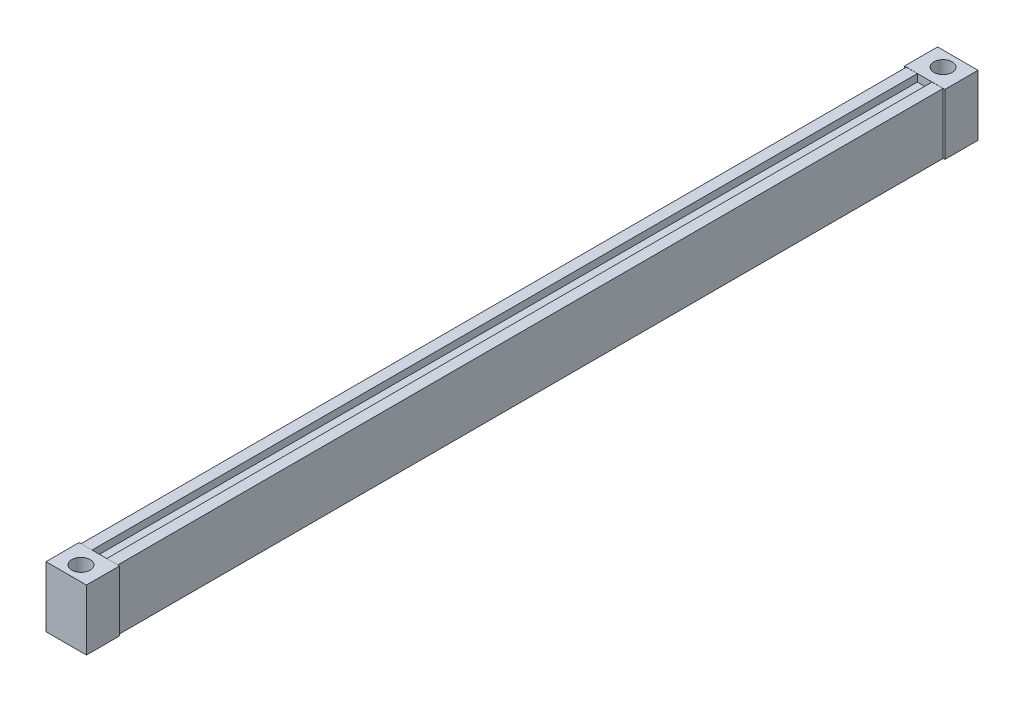
ISO-10303-21;
HEADER;
FILE_DESCRIPTION(('STEP AP214'),'2;1');
FILE_NAME('part.step','',(''),(''),'','','');
FILE_SCHEMA(('AUTOMOTIVE_DESIGN { 1 0 10303 214 1 1 1 1 }'));
ENDSEC;
DATA;
#1=APPLICATION_CONTEXT('core data for automotive mechanical design processes');
#2=APPLICATION_PROTOCOL_DEFINITION('international standard','automotive_design',2000,#1);
#3=PRODUCT_CONTEXT('',#1,'mechanical');
#4=PRODUCT('Part','Part','',(#3));
#5=PRODUCT_RELATED_PRODUCT_CATEGORY('part','',(#4));
#6=PRODUCT_DEFINITION_FORMATION('','',#4);
#7=PRODUCT_DEFINITION_CONTEXT('part definition',#1,'design');
#8=PRODUCT_DEFINITION('design','',#6,#7);
#9=PRODUCT_DEFINITION_SHAPE('','',#8);
#10=(LENGTH_UNIT() NAMED_UNIT(*) SI_UNIT(.MILLI.,.METRE.));
#11=(NAMED_UNIT(*) PLANE_ANGLE_UNIT() SI_UNIT($,.RADIAN.));
#12=(NAMED_UNIT(*) SI_UNIT($,.STERADIAN.) SOLID_ANGLE_UNIT());
#13=UNCERTAINTY_MEASURE_WITH_UNIT(LENGTH_MEASURE(1.E-05),#10,'distance_accuracy_value','');
#14=(GEOMETRIC_REPRESENTATION_CONTEXT(3) GLOBAL_UNCERTAINTY_ASSIGNED_CONTEXT((#13)) GLOBAL_UNIT_ASSIGNED_CONTEXT((#10,
#11,#12)) REPRESENTATION_CONTEXT('',''));
#15=CARTESIAN_POINT('',(0.,0.,0.));
#16=DIRECTION('',(0.,0.,1.));
#17=DIRECTION('',(1.,0.,0.));
#18=AXIS2_PLACEMENT_3D('',#15,#16,#17);
#19=CARTESIAN_POINT('',(-4.49999999999997,-7.74074074074076,234.5));
#20=DIRECTION('',(0.,1.,0.));
#21=DIRECTION('',(-1.,0.,0.));
#22=AXIS2_PLACEMENT_3D('',#19,#20,#21);
#23=CYLINDRICAL_SURFACE('',#22,2.5);
#24=CARTESIAN_POINT('',(-4.49999999999997,-7.6791153095827,234.5));
#25=DIRECTION('',(0.,-1.,0.));
#26=DIRECTION('',(-1.,0.,0.));
#27=AXIS2_PLACEMENT_3D('',#24,#25,#26);
#28=CIRCLE('',#27,2.5);
#29=CARTESIAN_POINT('',(-6.99999999999998,-7.6791153095827,234.5));
#30=VERTEX_POINT('',#29);
#31=EDGE_CURVE('E121',#30,#30,#28,.T.);
#32=ORIENTED_EDGE('',*,*,#31,.T.);
#33=EDGE_LOOP('',(#32));
#34=FACE_BOUND('',#33,.T.);
#35=CARTESIAN_POINT('',(-4.49999999999997,-2.6791153095827,234.5));
#36=DIRECTION('',(0.,-1.,0.));
#37=DIRECTION('',(-1.,0.,0.));
#38=AXIS2_PLACEMENT_3D('',#35,#36,#37);
#39=CIRCLE('',#38,2.5);
#40=CARTESIAN_POINT('',(-6.99999999999998,-2.6791153095827,234.5));
#41=VERTEX_POINT('',#40);
#42=EDGE_CURVE('E168',#41,#41,#39,.T.);
#43=ORIENTED_EDGE('',*,*,#42,.F.);
#44=EDGE_LOOP('',(#43));
#45=FACE_BOUND('',#44,.T.);
#46=ADVANCED_FACE('F52',(#34,#45),#23,.F.);
#47=CARTESIAN_POINT('',(6.50000000000002,0.,242.5));
#48=DIRECTION('',(1.,0.,0.));
#49=DIRECTION('',(0.,1.,0.));
#50=AXIS2_PLACEMENT_3D('',#47,#48,#49);
#51=PLANE('',#50);
#52=DIRECTION('',(0.,1.,0.));
#53=VECTOR('',#52,1.);
#54=CARTESIAN_POINT('',(6.50000000000002,0.,224.5));
#55=LINE('',#54,#53);
#56=CARTESIAN_POINT('',(6.50000000000002,-7.6791153095827,224.5));
#57=VERTEX_POINT('',#56);
#58=CARTESIAN_POINT('',(6.50000000000002,25.3208846904173,224.5));
#59=VERTEX_POINT('',#58);
#60=EDGE_CURVE('E117',#57,#59,#55,.T.);
#61=ORIENTED_EDGE('',*,*,#60,.T.);
#62=DIRECTION('',(0.,0.,-1.));
#63=VECTOR('',#62,1.);
#64=CARTESIAN_POINT('',(6.50000000000002,25.3208846904173,242.5));
#65=LINE('',#64,#63);
#66=CARTESIAN_POINT('',(6.50000000000002,25.3208846904173,242.5));
#67=VERTEX_POINT('',#66);
#68=EDGE_CURVE('E116',#67,#59,#65,.T.);
#69=ORIENTED_EDGE('',*,*,#68,.F.);
#70=DIRECTION('',(0.,1.,0.));
#71=VECTOR('',#70,1.);
#72=CARTESIAN_POINT('',(6.50000000000002,0.,242.5));
#73=LINE('',#72,#71);
#74=CARTESIAN_POINT('',(6.50000000000002,-7.6791153095827,242.5));
#75=VERTEX_POINT('',#74);
#76=EDGE_CURVE('E110',#75,#67,#73,.T.);
#77=ORIENTED_EDGE('',*,*,#76,.F.);
#78=DIRECTION('',(0.,0.,-1.));
#79=VECTOR('',#78,1.);
#80=CARTESIAN_POINT('',(6.50000000000002,-7.6791153095827,242.5));
#81=LINE('',#80,#79);
#82=EDGE_CURVE('E12',#75,#57,#81,.T.);
#83=ORIENTED_EDGE('',*,*,#82,.T.);
#84=EDGE_LOOP('',(#61,#69,#77,#83));
#85=FACE_BOUND('',#84,.T.);
#86=ADVANCED_FACE('F54',(#85),#51,.T.);
#87=CARTESIAN_POINT('',(0.,-7.6791153095827,242.5));
#88=DIRECTION('',(0.,1.,0.));
#89=DIRECTION('',(-1.,0.,0.));
#90=AXIS2_PLACEMENT_3D('',#87,#88,#89);
#91=PLANE('',#90);
#92=ORIENTED_EDGE('',*,*,#31,.F.);
#93=EDGE_LOOP('',(#92));
#94=FACE_BOUND('',#93,.T.);
#95=DIRECTION('',(-1.,0.,0.));
#96=VECTOR('',#95,1.);
#97=CARTESIAN_POINT('',(0.,-7.6791153095827,224.5));
#98=LINE('',#97,#96);
#99=CARTESIAN_POINT('',(-15.5,-7.6791153095827,224.5));
#100=VERTEX_POINT('',#99);
#101=EDGE_CURVE('E120',#57,#100,#98,.T.);
#102=ORIENTED_EDGE('',*,*,#101,.F.);
#103=ORIENTED_EDGE('',*,*,#82,.F.);
#104=DIRECTION('',(-1.,0.,0.));
#105=VECTOR('',#104,1.);
#106=CARTESIAN_POINT('',(0.,-7.6791153095827,242.5));
#107=LINE('',#106,#105);
#108=CARTESIAN_POINT('',(-15.5,-7.6791153095827,242.5));
#109=VERTEX_POINT('',#108);
#110=EDGE_CURVE('E94',#75,#109,#107,.T.);
#111=ORIENTED_EDGE('',*,*,#110,.T.);
#112=DIRECTION('',(0.,0.,-1.));
#113=VECTOR('',#112,1.);
#114=CARTESIAN_POINT('',(-15.5,-7.6791153095827,242.5));
#115=LINE('',#114,#113);
#116=EDGE_CURVE('E61',#109,#100,#115,.T.);
#117=ORIENTED_EDGE('',*,*,#116,.T.);
#118=EDGE_LOOP('',(#102,#103,#111,#117));
#119=FACE_BOUND('',#118,.T.);
#120=ADVANCED_FACE('F108',(#94,#119),#91,.F.);
#121=CARTESIAN_POINT('',(-15.5,0.,242.5));
#122=DIRECTION('',(1.,0.,0.));
#123=DIRECTION('',(0.,1.,0.));
#124=AXIS2_PLACEMENT_3D('',#121,#122,#123);
#125=PLANE('',#124);
#126=DIRECTION('',(0.,1.,0.));
#127=VECTOR('',#126,1.);
#128=CARTESIAN_POINT('',(-15.5,0.,224.5));
#129=LINE('',#128,#127);
#130=CARTESIAN_POINT('',(-15.5,25.3208846904173,224.5));
#131=VERTEX_POINT('',#130);
#132=EDGE_CURVE('E104',#100,#131,#129,.T.);
#133=ORIENTED_EDGE('',*,*,#132,.F.);
#134=ORIENTED_EDGE('',*,*,#116,.F.);
#135=DIRECTION('',(0.,1.,0.));
#136=VECTOR('',#135,1.);
#137=CARTESIAN_POINT('',(-15.5,0.,242.5));
#138=LINE('',#137,#136);
#139=CARTESIAN_POINT('',(-15.5,25.3208846904173,242.5));
#140=VERTEX_POINT('',#139);
#141=EDGE_CURVE('E97',#109,#140,#138,.T.);
#142=ORIENTED_EDGE('',*,*,#141,.T.);
#143=DIRECTION('',(0.,0.,-1.));
#144=VECTOR('',#143,1.);
#145=CARTESIAN_POINT('',(-15.5,25.3208846904173,242.5));
#146=LINE('',#145,#144);
#147=EDGE_CURVE('E107',#140,#131,#146,.T.);
#148=ORIENTED_EDGE('',*,*,#147,.T.);
#149=EDGE_LOOP('',(#133,#134,#142,#148));
#150=FACE_BOUND('',#149,.T.);
#151=ADVANCED_FACE('F103',(#150),#125,.F.);
#152=CARTESIAN_POINT('',(0.,25.3208846904173,242.5));
#153=DIRECTION('',(0.,1.,0.));
#154=DIRECTION('',(-1.,0.,0.));
#155=AXIS2_PLACEMENT_3D('',#152,#153,#154);
#156=PLANE('',#155);
#157=CARTESIAN_POINT('',(-4.49999999999997,25.3208846904173,234.5));
#158=DIRECTION('',(0.,-1.,0.));
#159=DIRECTION('',(-1.,0.,0.));
#160=AXIS2_PLACEMENT_3D('',#157,#158,#159);
#161=CIRCLE('',#160,5.);
#162=CARTESIAN_POINT('',(-9.49999999999997,25.3208846904173,234.5));
#163=VERTEX_POINT('',#162);
#164=EDGE_CURVE('E167',#163,#163,#161,.T.);
#165=ORIENTED_EDGE('',*,*,#164,.T.);
#166=EDGE_LOOP('',(#165));
#167=FACE_BOUND('',#166,.T.);
#168=DIRECTION('',(-1.,0.,0.));
#169=VECTOR('',#168,1.);
#170=CARTESIAN_POINT('',(0.,25.3208846904173,224.5));
#171=LINE('',#170,#169);
#172=EDGE_CURVE('E83',#59,#131,#171,.T.);
#173=ORIENTED_EDGE('',*,*,#172,.T.);
#174=ORIENTED_EDGE('',*,*,#147,.F.);
#175=DIRECTION('',(-1.,0.,0.));
#176=VECTOR('',#175,1.);
#177=CARTESIAN_POINT('',(0.,25.3208846904173,242.5));
#178=LINE('',#177,#176);
#179=EDGE_CURVE('E69',#67,#140,#178,.T.);
#180=ORIENTED_EDGE('',*,*,#179,.F.);
#181=ORIENTED_EDGE('',*,*,#68,.T.);
#182=EDGE_LOOP('',(#173,#174,#180,#181));
#183=FACE_BOUND('',#182,.T.);
#184=ADVANCED_FACE('F129',(#167,#183),#156,.T.);
#185=CARTESIAN_POINT('',(0.,0.,242.5));
#186=DIRECTION('',(0.,0.,1.));
#187=DIRECTION('',(-1.,0.,0.));
#188=AXIS2_PLACEMENT_3D('',#185,#186,#187);
#189=PLANE('',#188);
#190=ORIENTED_EDGE('',*,*,#76,.T.);
#191=ORIENTED_EDGE('',*,*,#179,.T.);
#192=ORIENTED_EDGE('',*,*,#141,.F.);
#193=ORIENTED_EDGE('',*,*,#110,.F.);
#194=EDGE_LOOP('',(#190,#191,#192,#193));
#195=FACE_BOUND('',#194,.T.);
#196=ADVANCED_FACE('F99',(#195),#189,.T.);
#197=CARTESIAN_POINT('',(0.,0.,224.5));
#198=DIRECTION('',(0.,0.,1.));
#199=DIRECTION('',(-1.,0.,0.));
#200=AXIS2_PLACEMENT_3D('',#197,#198,#199);
#201=PLANE('',#200);
#202=ORIENTED_EDGE('',*,*,#60,.F.);
#203=ORIENTED_EDGE('',*,*,#101,.T.);
#204=ORIENTED_EDGE('',*,*,#132,.T.);
#205=ORIENTED_EDGE('',*,*,#172,.F.);
#206=EDGE_LOOP('',(#202,#203,#204,#205));
#207=FACE_BOUND('',#206,.T.);
#208=ADVANCED_FACE('F126',(#207),#201,.F.);
#209=CARTESIAN_POINT('',(-4.49999999999997,-2.6791153095827,234.5));
#210=DIRECTION('',(0.,1.,0.));
#211=DIRECTION('',(-1.,0.,0.));
#212=AXIS2_PLACEMENT_3D('',#209,#210,#211);
#213=CYLINDRICAL_SURFACE('',#212,5.);
#214=CARTESIAN_POINT('',(-4.49999999999997,-2.6791153095827,234.5));
#215=DIRECTION('',(0.,-1.,0.));
#216=DIRECTION('',(-1.,0.,0.));
#217=AXIS2_PLACEMENT_3D('',#214,#215,#216);
#218=CIRCLE('',#217,5.);
#219=CARTESIAN_POINT('',(-9.49999999999998,-2.6791153095827,234.5));
#220=VERTEX_POINT('',#219);
#221=EDGE_CURVE('E165',#220,#220,#218,.T.);
#222=ORIENTED_EDGE('',*,*,#221,.T.);
#223=EDGE_LOOP('',(#222));
#224=FACE_BOUND('',#223,.T.);
#225=ORIENTED_EDGE('',*,*,#164,.F.);
#226=EDGE_LOOP('',(#225));
#227=FACE_BOUND('',#226,.T.);
#228=ADVANCED_FACE('F150',(#224,#227),#213,.F.);
#229=CARTESIAN_POINT('',(-4.49999999999997,-2.6791153095827,234.5));
#230=DIRECTION('',(0.,1.,0.));
#231=DIRECTION('',(-1.,0.,0.));
#232=AXIS2_PLACEMENT_3D('',#229,#230,#231);
#233=PLANE('',#232);
#234=ORIENTED_EDGE('',*,*,#42,.T.);
#235=EDGE_LOOP('',(#234));
#236=FACE_BOUND('',#235,.T.);
#237=ORIENTED_EDGE('',*,*,#221,.F.);
#238=EDGE_LOOP('',(#237));
#239=FACE_BOUND('',#238,.T.);
#240=ADVANCED_FACE('F156',(#236,#239),#233,.T.);
#241=CLOSED_SHELL('',(#46,#86,#120,#151,#184,#196,#208,#228,#240));
#242=MANIFOLD_SOLID_BREP('B2',#241);
#243=CARTESIAN_POINT('',(-4.49999999999997,-7.74074074074076,-234.5));
#244=DIRECTION('',(0.,1.,0.));
#245=DIRECTION('',(-1.,0.,0.));
#246=AXIS2_PLACEMENT_3D('',#243,#244,#245);
#247=CYLINDRICAL_SURFACE('',#246,2.5);
#248=CARTESIAN_POINT('',(-4.49999999999997,-7.6791153095827,-234.5));
#249=DIRECTION('',(0.,1.,0.));
#250=DIRECTION('',(-1.,0.,0.));
#251=AXIS2_PLACEMENT_3D('',#248,#249,#250);
#252=CIRCLE('',#251,2.5);
#253=CARTESIAN_POINT('',(-6.99999999999998,-7.6791153095827,-234.5));
#254=VERTEX_POINT('',#253);
#255=EDGE_CURVE('E317',#254,#254,#252,.T.);
#256=ORIENTED_EDGE('',*,*,#255,.F.);
#257=EDGE_LOOP('',(#256));
#258=FACE_BOUND('',#257,.T.);
#259=CARTESIAN_POINT('',(-4.49999999999997,-2.6791153095827,-234.5));
#260=DIRECTION('',(0.,1.,0.));
#261=DIRECTION('',(-1.,0.,0.));
#262=AXIS2_PLACEMENT_3D('',#259,#260,#261);
#263=CIRCLE('',#262,2.5);
#264=CARTESIAN_POINT('',(-6.99999999999998,-2.6791153095827,-234.5));
#265=VERTEX_POINT('',#264);
#266=EDGE_CURVE('E333',#265,#265,#263,.T.);
#267=ORIENTED_EDGE('',*,*,#266,.T.);
#268=EDGE_LOOP('',(#267));
#269=FACE_BOUND('',#268,.T.);
#270=ADVANCED_FACE('F251',(#258,#269),#247,.F.);
#271=CARTESIAN_POINT('',(6.50000000000002,0.,-242.5));
#272=DIRECTION('',(1.,0.,0.));
#273=DIRECTION('',(0.,1.,0.));
#274=AXIS2_PLACEMENT_3D('',#271,#272,#273);
#275=PLANE('',#274);
#276=DIRECTION('',(0.,1.,0.));
#277=VECTOR('',#276,1.);
#278=CARTESIAN_POINT('',(6.50000000000002,0.,-224.5));
#279=LINE('',#278,#277);
#280=CARTESIAN_POINT('',(6.50000000000002,-7.6791153095827,-224.5));
#281=VERTEX_POINT('',#280);
#282=CARTESIAN_POINT('',(6.50000000000002,25.3208846904173,-224.5));
#283=VERTEX_POINT('',#282);
#284=EDGE_CURVE('E315',#281,#283,#279,.T.);
#285=ORIENTED_EDGE('',*,*,#284,.F.);
#286=DIRECTION('',(0.,0.,1.));
#287=VECTOR('',#286,1.);
#288=CARTESIAN_POINT('',(6.50000000000002,-7.6791153095827,-242.5));
#289=LINE('',#288,#287);
#290=CARTESIAN_POINT('',(6.50000000000002,-7.6791153095827,-242.5));
#291=VERTEX_POINT('',#290);
#292=EDGE_CURVE('E50',#291,#281,#289,.T.);
#293=ORIENTED_EDGE('',*,*,#292,.F.);
#294=DIRECTION('',(0.,1.,0.));
#295=VECTOR('',#294,1.);
#296=CARTESIAN_POINT('',(6.50000000000002,0.,-242.5));
#297=LINE('',#296,#295);
#298=CARTESIAN_POINT('',(6.50000000000002,25.3208846904173,-242.5));
#299=VERTEX_POINT('',#298);
#300=EDGE_CURVE('E300',#291,#299,#297,.T.);
#301=ORIENTED_EDGE('',*,*,#300,.T.);
#302=DIRECTION('',(0.,0.,1.));
#303=VECTOR('',#302,1.);
#304=CARTESIAN_POINT('',(6.50000000000002,25.3208846904173,-242.5));
#305=LINE('',#304,#303);
#306=EDGE_CURVE('E268',#299,#283,#305,.T.);
#307=ORIENTED_EDGE('',*,*,#306,.T.);
#308=EDGE_LOOP('',(#285,#293,#301,#307));
#309=FACE_BOUND('',#308,.T.);
#310=ADVANCED_FACE('F253',(#309),#275,.T.);
#311=CARTESIAN_POINT('',(0.,-7.6791153095827,-242.5));
#312=DIRECTION('',(0.,1.,0.));
#313=DIRECTION('',(-1.,0.,0.));
#314=AXIS2_PLACEMENT_3D('',#311,#312,#313);
#315=PLANE('',#314);
#316=ORIENTED_EDGE('',*,*,#255,.T.);
#317=EDGE_LOOP('',(#316));
#318=FACE_BOUND('',#317,.T.);
#319=DIRECTION('',(-1.,0.,0.));
#320=VECTOR('',#319,1.);
#321=CARTESIAN_POINT('',(0.,-7.6791153095827,-224.5));
#322=LINE('',#321,#320);
#323=CARTESIAN_POINT('',(-15.5,-7.6791153095827,-224.5));
#324=VERTEX_POINT('',#323);
#325=EDGE_CURVE('E306',#281,#324,#322,.T.);
#326=ORIENTED_EDGE('',*,*,#325,.T.);
#327=DIRECTION('',(0.,0.,1.));
#328=VECTOR('',#327,1.);
#329=CARTESIAN_POINT('',(-15.5,-7.6791153095827,-242.5));
#330=LINE('',#329,#328);
#331=CARTESIAN_POINT('',(-15.5,-7.6791153095827,-242.5));
#332=VERTEX_POINT('',#331);
#333=EDGE_CURVE('E260',#332,#324,#330,.T.);
#334=ORIENTED_EDGE('',*,*,#333,.F.);
#335=DIRECTION('',(-1.,0.,0.));
#336=VECTOR('',#335,1.);
#337=CARTESIAN_POINT('',(0.,-7.6791153095827,-242.5));
#338=LINE('',#337,#336);
#339=EDGE_CURVE('E294',#291,#332,#338,.T.);
#340=ORIENTED_EDGE('',*,*,#339,.F.);
#341=ORIENTED_EDGE('',*,*,#292,.T.);
#342=EDGE_LOOP('',(#326,#334,#340,#341));
#343=FACE_BOUND('',#342,.T.);
#344=ADVANCED_FACE('F304',(#318,#343),#315,.F.);
#345=CARTESIAN_POINT('',(-15.5,0.,-242.5));
#346=DIRECTION('',(1.,0.,0.));
#347=DIRECTION('',(0.,1.,0.));
#348=AXIS2_PLACEMENT_3D('',#345,#346,#347);
#349=PLANE('',#348);
#350=DIRECTION('',(0.,1.,0.));
#351=VECTOR('',#350,1.);
#352=CARTESIAN_POINT('',(-15.5,0.,-224.5));
#353=LINE('',#352,#351);
#354=CARTESIAN_POINT('',(-15.5,25.3208846904173,-224.5));
#355=VERTEX_POINT('',#354);
#356=EDGE_CURVE('E319',#324,#355,#353,.T.);
#357=ORIENTED_EDGE('',*,*,#356,.T.);
#358=DIRECTION('',(0.,0.,1.));
#359=VECTOR('',#358,1.);
#360=CARTESIAN_POINT('',(-15.5,25.3208846904173,-242.5));
#361=LINE('',#360,#359);
#362=CARTESIAN_POINT('',(-15.5,25.3208846904173,-242.5));
#363=VERTEX_POINT('',#362);
#364=EDGE_CURVE('E282',#363,#355,#361,.T.);
#365=ORIENTED_EDGE('',*,*,#364,.F.);
#366=DIRECTION('',(0.,1.,0.));
#367=VECTOR('',#366,1.);
#368=CARTESIAN_POINT('',(-15.5,0.,-242.5));
#369=LINE('',#368,#367);
#370=EDGE_CURVE('E299',#332,#363,#369,.T.);
#371=ORIENTED_EDGE('',*,*,#370,.F.);
#372=ORIENTED_EDGE('',*,*,#333,.T.);
#373=EDGE_LOOP('',(#357,#365,#371,#372));
#374=FACE_BOUND('',#373,.T.);
#375=ADVANCED_FACE('F309',(#374),#349,.F.);
#376=CARTESIAN_POINT('',(0.,25.3208846904173,-242.5));
#377=DIRECTION('',(0.,1.,0.));
#378=DIRECTION('',(-1.,0.,0.));
#379=AXIS2_PLACEMENT_3D('',#376,#377,#378);
#380=PLANE('',#379);
#381=CARTESIAN_POINT('',(-4.49999999999997,25.3208846904173,-234.5));
#382=DIRECTION('',(0.,1.,0.));
#383=DIRECTION('',(-1.,0.,0.));
#384=AXIS2_PLACEMENT_3D('',#381,#382,#383);
#385=CIRCLE('',#384,5.);
#386=CARTESIAN_POINT('',(-9.49999999999997,25.3208846904173,-234.5));
#387=VERTEX_POINT('',#386);
#388=EDGE_CURVE('E330',#387,#387,#385,.T.);
#389=ORIENTED_EDGE('',*,*,#388,.F.);
#390=EDGE_LOOP('',(#389));
#391=FACE_BOUND('',#390,.T.);
#392=DIRECTION('',(-1.,0.,0.));
#393=VECTOR('',#392,1.);
#394=CARTESIAN_POINT('',(0.,25.3208846904173,-224.5));
#395=LINE('',#394,#393);
#396=EDGE_CURVE('E321',#283,#355,#395,.T.);
#397=ORIENTED_EDGE('',*,*,#396,.F.);
#398=ORIENTED_EDGE('',*,*,#306,.F.);
#399=DIRECTION('',(-1.,0.,0.));
#400=VECTOR('',#399,1.);
#401=CARTESIAN_POINT('',(0.,25.3208846904173,-242.5));
#402=LINE('',#401,#400);
#403=EDGE_CURVE('E310',#299,#363,#402,.T.);
#404=ORIENTED_EDGE('',*,*,#403,.T.);
#405=ORIENTED_EDGE('',*,*,#364,.T.);
#406=EDGE_LOOP('',(#397,#398,#404,#405));
#407=FACE_BOUND('',#406,.T.);
#408=ADVANCED_FACE('F353',(#391,#407),#380,.T.);
#409=CARTESIAN_POINT('',(0.,0.,-242.5));
#410=DIRECTION('',(0.,0.,-1.));
#411=DIRECTION('',(-1.,0.,0.));
#412=AXIS2_PLACEMENT_3D('',#409,#410,#411);
#413=PLANE('',#412);
#414=ORIENTED_EDGE('',*,*,#300,.F.);
#415=ORIENTED_EDGE('',*,*,#339,.T.);
#416=ORIENTED_EDGE('',*,*,#370,.T.);
#417=ORIENTED_EDGE('',*,*,#403,.F.);
#418=EDGE_LOOP('',(#414,#415,#416,#417));
#419=FACE_BOUND('',#418,.T.);
#420=ADVANCED_FACE('F296',(#419),#413,.T.);
#421=CARTESIAN_POINT('',(0.,0.,-224.5));
#422=DIRECTION('',(0.,0.,-1.));
#423=DIRECTION('',(-1.,0.,0.));
#424=AXIS2_PLACEMENT_3D('',#421,#422,#423);
#425=PLANE('',#424);
#426=ORIENTED_EDGE('',*,*,#284,.T.);
#427=ORIENTED_EDGE('',*,*,#396,.T.);
#428=ORIENTED_EDGE('',*,*,#356,.F.);
#429=ORIENTED_EDGE('',*,*,#325,.F.);
#430=EDGE_LOOP('',(#426,#427,#428,#429));
#431=FACE_BOUND('',#430,.T.);
#432=ADVANCED_FACE('F349',(#431),#425,.F.);
#433=CARTESIAN_POINT('',(-4.49999999999997,-2.6791153095827,-234.5));
#434=DIRECTION('',(0.,1.,0.));
#435=DIRECTION('',(-1.,0.,0.));
#436=AXIS2_PLACEMENT_3D('',#433,#434,#435);
#437=CYLINDRICAL_SURFACE('',#436,5.);
#438=CARTESIAN_POINT('',(-4.49999999999997,-2.6791153095827,-234.5));
#439=DIRECTION('',(0.,1.,0.));
#440=DIRECTION('',(-1.,0.,0.));
#441=AXIS2_PLACEMENT_3D('',#438,#439,#440);
#442=CIRCLE('',#441,5.);
#443=CARTESIAN_POINT('',(-9.49999999999998,-2.6791153095827,-234.5));
#444=VERTEX_POINT('',#443);
#445=EDGE_CURVE('E329',#444,#444,#442,.T.);
#446=ORIENTED_EDGE('',*,*,#445,.F.);
#447=EDGE_LOOP('',(#446));
#448=FACE_BOUND('',#447,.T.);
#449=ORIENTED_EDGE('',*,*,#388,.T.);
#450=EDGE_LOOP('',(#449));
#451=FACE_BOUND('',#450,.T.);
#452=ADVANCED_FACE('F343',(#448,#451),#437,.F.);
#453=CARTESIAN_POINT('',(-4.49999999999997,-2.6791153095827,-234.5));
#454=DIRECTION('',(0.,1.,0.));
#455=DIRECTION('',(-1.,0.,0.));
#456=AXIS2_PLACEMENT_3D('',#453,#454,#455);
#457=PLANE('',#456);
#458=ORIENTED_EDGE('',*,*,#266,.F.);
#459=EDGE_LOOP('',(#458));
#460=FACE_BOUND('',#459,.T.);
#461=ORIENTED_EDGE('',*,*,#445,.T.);
#462=EDGE_LOOP('',(#461));
#463=FACE_BOUND('',#462,.T.);
#464=ADVANCED_FACE('F340',(#460,#463),#457,.T.);
#465=CLOSED_SHELL('',(#270,#310,#344,#375,#408,#420,#432,#452,#464));
#466=MANIFOLD_SOLID_BREP('B6',#465);
#467=CARTESIAN_POINT('',(-14.5,25.2592592592592,224.5));
#468=DIRECTION('',(0.,-1.,0.));
#469=DIRECTION('',(0.,0.,-1.));
#470=AXIS2_PLACEMENT_3D('',#467,#468,#469);
#471=PLANE('',#470);
#472=DIRECTION('',(-1.,0.,0.));
#473=VECTOR('',#472,1.);
#474=CARTESIAN_POINT('',(-14.5,25.2592592592592,-224.5));
#475=LINE('',#474,#473);
#476=CARTESIAN_POINT('',(5.50000000000002,25.2592592592592,-224.5));
#477=VERTEX_POINT('',#476);
#478=CARTESIAN_POINT('',(-0.499999999999926,25.2592592592592,-224.5));
#479=VERTEX_POINT('',#478);
#480=EDGE_CURVE('E544',#477,#479,#475,.T.);
#481=ORIENTED_EDGE('',*,*,#480,.T.);
#482=DIRECTION('',(0.,0.,-1.));
#483=VECTOR('',#482,1.);
#484=CARTESIAN_POINT('',(-0.499999999999926,25.2592592592592,-224.5));
#485=LINE('',#484,#483);
#486=CARTESIAN_POINT('',(-0.499999999999926,25.2592592592592,224.5));
#487=VERTEX_POINT('',#486);
#488=EDGE_CURVE('E580',#487,#479,#485,.T.);
#489=ORIENTED_EDGE('',*,*,#488,.F.);
#490=DIRECTION('',(-1.,0.,0.));
#491=VECTOR('',#490,1.);
#492=CARTESIAN_POINT('',(-14.5,25.2592592592592,224.5));
#493=LINE('',#492,#491);
#494=CARTESIAN_POINT('',(5.50000000000002,25.2592592592592,224.5));
#495=VERTEX_POINT('',#494);
#496=EDGE_CURVE('E553',#495,#487,#493,.T.);
#497=ORIENTED_EDGE('',*,*,#496,.F.);
#498=DIRECTION('',(0.,0.,-1.));
#499=VECTOR('',#498,1.);
#500=CARTESIAN_POINT('',(5.50000000000002,25.2592592592592,224.5));
#501=LINE('',#500,#499);
#502=EDGE_CURVE('E560',#495,#477,#501,.T.);
#503=ORIENTED_EDGE('',*,*,#502,.T.);
#504=EDGE_LOOP('',(#481,#489,#497,#503));
#505=FACE_BOUND('',#504,.T.);
#506=ADVANCED_FACE('F441',(#505),#471,.F.);
#507=CARTESIAN_POINT('',(-14.5,25.2592592592592,224.5));
#508=DIRECTION('',(1.,0.,0.));
#509=DIRECTION('',(0.,1.,0.));
#510=AXIS2_PLACEMENT_3D('',#507,#508,#509);
#511=PLANE('',#510);
#512=DIRECTION('',(0.,0.,-1.));
#513=VECTOR('',#512,1.);
#514=CARTESIAN_POINT('',(-14.5,25.2592592592592,224.5));
#515=LINE('',#514,#513);
#516=CARTESIAN_POINT('',(-14.5,25.2592592592592,224.5));
#517=VERTEX_POINT('',#516);
#518=CARTESIAN_POINT('',(-14.5,25.2592592592592,-224.5));
#519=VERTEX_POINT('',#518);
#520=EDGE_CURVE('E556',#517,#519,#515,.T.);
#521=ORIENTED_EDGE('',*,*,#520,.T.);
#522=DIRECTION('',(0.,-1.,0.));
#523=VECTOR('',#522,1.);
#524=CARTESIAN_POINT('',(-14.5,25.2592592592592,-224.5));
#525=LINE('',#524,#523);
#526=CARTESIAN_POINT('',(-14.5,-7.74074074074076,-224.5));
#527=VERTEX_POINT('',#526);
#528=EDGE_CURVE('E535',#519,#527,#525,.T.);
#529=ORIENTED_EDGE('',*,*,#528,.T.);
#530=DIRECTION('',(0.,0.,-1.));
#531=VECTOR('',#530,1.);
#532=CARTESIAN_POINT('',(-14.5,-7.74074074074076,224.5));
#533=LINE('',#532,#531);
#534=CARTESIAN_POINT('',(-14.5,-7.74074074074076,224.5));
#535=VERTEX_POINT('',#534);
#536=EDGE_CURVE('E249',#535,#527,#533,.T.);
#537=ORIENTED_EDGE('',*,*,#536,.F.);
#538=DIRECTION('',(0.,-1.,0.));
#539=VECTOR('',#538,1.);
#540=CARTESIAN_POINT('',(-14.5,25.2592592592592,224.5));
#541=LINE('',#540,#539);
#542=EDGE_CURVE('E547',#517,#535,#541,.T.);
#543=ORIENTED_EDGE('',*,*,#542,.F.);
#544=EDGE_LOOP('',(#521,#529,#537,#543));
#545=FACE_BOUND('',#544,.T.);
#546=ADVANCED_FACE('F443',(#545),#511,.F.);
#547=CARTESIAN_POINT('',(-14.5,-7.74074074074076,224.5));
#548=DIRECTION('',(0.,1.,0.));
#549=DIRECTION('',(0.,0.,1.));
#550=AXIS2_PLACEMENT_3D('',#547,#548,#549);
#551=PLANE('',#550);
#552=ORIENTED_EDGE('',*,*,#536,.T.);
#553=DIRECTION('',(1.,0.,0.));
#554=VECTOR('',#553,1.);
#555=CARTESIAN_POINT('',(-14.5,-7.74074074074076,-224.5));
#556=LINE('',#555,#554);
#557=CARTESIAN_POINT('',(5.50000000000002,-7.74074074074076,-224.5));
#558=VERTEX_POINT('',#557);
#559=EDGE_CURVE('E538',#527,#558,#556,.T.);
#560=ORIENTED_EDGE('',*,*,#559,.T.);
#561=DIRECTION('',(0.,0.,-1.));
#562=VECTOR('',#561,1.);
#563=CARTESIAN_POINT('',(5.50000000000002,-7.74074074074076,224.5));
#564=LINE('',#563,#562);
#565=CARTESIAN_POINT('',(5.50000000000002,-7.74074074074076,224.5));
#566=VERTEX_POINT('',#565);
#567=EDGE_CURVE('E450',#566,#558,#564,.T.);
#568=ORIENTED_EDGE('',*,*,#567,.F.);
#569=DIRECTION('',(1.,0.,0.));
#570=VECTOR('',#569,1.);
#571=CARTESIAN_POINT('',(-14.5,-7.74074074074076,224.5));
#572=LINE('',#571,#570);
#573=EDGE_CURVE('E549',#535,#566,#572,.T.);
#574=ORIENTED_EDGE('',*,*,#573,.F.);
#575=EDGE_LOOP('',(#552,#560,#568,#574));
#576=FACE_BOUND('',#575,.T.);
#577=ADVANCED_FACE('F572',(#576),#551,.F.);
#578=CARTESIAN_POINT('',(5.50000000000002,25.2592592592592,224.5));
#579=DIRECTION('',(-1.,0.,0.));
#580=DIRECTION('',(0.,-1.,0.));
#581=AXIS2_PLACEMENT_3D('',#578,#579,#580);
#582=PLANE('',#581);
#583=ORIENTED_EDGE('',*,*,#567,.T.);
#584=DIRECTION('',(0.,1.,0.));
#585=VECTOR('',#584,1.);
#586=CARTESIAN_POINT('',(5.50000000000002,25.2592592592592,-224.5));
#587=LINE('',#586,#585);
#588=EDGE_CURVE('E541',#558,#477,#587,.T.);
#589=ORIENTED_EDGE('',*,*,#588,.T.);
#590=ORIENTED_EDGE('',*,*,#502,.F.);
#591=DIRECTION('',(0.,1.,0.));
#592=VECTOR('',#591,1.);
#593=CARTESIAN_POINT('',(5.50000000000002,25.2592592592592,224.5));
#594=LINE('',#593,#592);
#595=EDGE_CURVE('E551',#566,#495,#594,.T.);
#596=ORIENTED_EDGE('',*,*,#595,.F.);
#597=EDGE_LOOP('',(#583,#589,#590,#596));
#598=FACE_BOUND('',#597,.T.);
#599=ADVANCED_FACE('F567',(#598),#582,.F.);
#600=CARTESIAN_POINT('',(-8.50000000000004,25.2592592592592,224.5));
#601=VERTEX_POINT('',#600);
#602=EDGE_CURVE('E465',#601,#517,#493,.T.);
#603=ORIENTED_EDGE('',*,*,#602,.F.);
#604=DIRECTION('',(0.,0.,1.));
#605=VECTOR('',#604,1.);
#606=CARTESIAN_POINT('',(-8.50000000000004,25.2592592592592,-224.5));
#607=LINE('',#606,#605);
#608=CARTESIAN_POINT('',(-8.50000000000004,25.2592592592592,-224.5));
#609=VERTEX_POINT('',#608);
#610=EDGE_CURVE('E578',#609,#601,#607,.T.);
#611=ORIENTED_EDGE('',*,*,#610,.F.);
#612=EDGE_CURVE('E527',#609,#519,#475,.T.);
#613=ORIENTED_EDGE('',*,*,#612,.T.);
#614=ORIENTED_EDGE('',*,*,#520,.F.);
#615=EDGE_LOOP('',(#603,#611,#613,#614));
#616=FACE_BOUND('',#615,.T.);
#617=ADVANCED_FACE('F577',(#616),#471,.F.);
#618=CARTESIAN_POINT('',(0.,0.,224.5));
#619=DIRECTION('',(0.,0.,1.));
#620=DIRECTION('',(1.,0.,0.));
#621=AXIS2_PLACEMENT_3D('',#618,#619,#620);
#622=PLANE('',#621);
#623=DIRECTION('',(0.,1.,0.));
#624=VECTOR('',#623,1.);
#625=CARTESIAN_POINT('',(-0.499999999999926,21.2592592592592,224.5));
#626=LINE('',#625,#624);
#627=CARTESIAN_POINT('',(-0.499999999999926,21.2592592592592,224.5));
#628=VERTEX_POINT('',#627);
#629=EDGE_CURVE('E530',#628,#487,#626,.T.);
#630=ORIENTED_EDGE('',*,*,#629,.F.);
#631=DIRECTION('',(1.,0.,0.));
#632=VECTOR('',#631,1.);
#633=CARTESIAN_POINT('',(-8.50000000000004,21.2592592592592,224.5));
#634=LINE('',#633,#632);
#635=CARTESIAN_POINT('',(-8.50000000000004,21.2592592592592,224.5));
#636=VERTEX_POINT('',#635);
#637=EDGE_CURVE('E516',#636,#628,#634,.T.);
#638=ORIENTED_EDGE('',*,*,#637,.F.);
#639=DIRECTION('',(0.,1.,0.));
#640=VECTOR('',#639,1.);
#641=CARTESIAN_POINT('',(-8.50000000000004,21.2592592592592,224.5));
#642=LINE('',#641,#640);
#643=EDGE_CURVE('E513',#636,#601,#642,.T.);
#644=ORIENTED_EDGE('',*,*,#643,.T.);
#645=ORIENTED_EDGE('',*,*,#602,.T.);
#646=ORIENTED_EDGE('',*,*,#542,.T.);
#647=ORIENTED_EDGE('',*,*,#573,.T.);
#648=ORIENTED_EDGE('',*,*,#595,.T.);
#649=ORIENTED_EDGE('',*,*,#496,.T.);
#650=EDGE_LOOP('',(#630,#638,#644,#645,#646,#647,#648,#649));
#651=FACE_BOUND('',#650,.T.);
#652=ADVANCED_FACE('F593',(#651),#622,.T.);
#653=CARTESIAN_POINT('',(0.,0.,-224.5));
#654=DIRECTION('',(0.,0.,1.));
#655=DIRECTION('',(1.,0.,0.));
#656=AXIS2_PLACEMENT_3D('',#653,#654,#655);
#657=PLANE('',#656);
#658=DIRECTION('',(-1.,0.,0.));
#659=VECTOR('',#658,1.);
#660=CARTESIAN_POINT('',(-8.50000000000004,21.2592592592592,-224.5));
#661=LINE('',#660,#659);
#662=CARTESIAN_POINT('',(-0.499999999999926,21.2592592592592,-224.5));
#663=VERTEX_POINT('',#662);
#664=CARTESIAN_POINT('',(-8.50000000000004,21.2592592592592,-224.5));
#665=VERTEX_POINT('',#664);
#666=EDGE_CURVE('E517',#663,#665,#661,.T.);
#667=ORIENTED_EDGE('',*,*,#666,.F.);
#668=DIRECTION('',(0.,1.,0.));
#669=VECTOR('',#668,1.);
#670=CARTESIAN_POINT('',(-0.499999999999926,21.2592592592592,-224.5));
#671=LINE('',#670,#669);
#672=EDGE_CURVE('E528',#663,#479,#671,.T.);
#673=ORIENTED_EDGE('',*,*,#672,.T.);
#674=ORIENTED_EDGE('',*,*,#480,.F.);
#675=ORIENTED_EDGE('',*,*,#588,.F.);
#676=ORIENTED_EDGE('',*,*,#559,.F.);
#677=ORIENTED_EDGE('',*,*,#528,.F.);
#678=ORIENTED_EDGE('',*,*,#612,.F.);
#679=DIRECTION('',(0.,1.,0.));
#680=VECTOR('',#679,1.);
#681=CARTESIAN_POINT('',(-8.50000000000004,21.2592592592592,-224.5));
#682=LINE('',#681,#680);
#683=EDGE_CURVE('E511',#665,#609,#682,.T.);
#684=ORIENTED_EDGE('',*,*,#683,.F.);
#685=EDGE_LOOP('',(#667,#673,#674,#675,#676,#677,#678,#684));
#686=FACE_BOUND('',#685,.T.);
#687=ADVANCED_FACE('F525',(#686),#657,.F.);
#688=CARTESIAN_POINT('',(-0.499999999999926,21.2592592592592,-224.5));
#689=DIRECTION('',(1.,0.,0.));
#690=DIRECTION('',(0.,0.,-1.));
#691=AXIS2_PLACEMENT_3D('',#688,#689,#690);
#692=PLANE('',#691);
#693=ORIENTED_EDGE('',*,*,#488,.T.);
#694=ORIENTED_EDGE('',*,*,#672,.F.);
#695=DIRECTION('',(0.,0.,-1.));
#696=VECTOR('',#695,1.);
#697=CARTESIAN_POINT('',(-0.499999999999926,21.2592592592592,-224.5));
#698=LINE('',#697,#696);
#699=EDGE_CURVE('E457',#628,#663,#698,.T.);
#700=ORIENTED_EDGE('',*,*,#699,.F.);
#701=ORIENTED_EDGE('',*,*,#629,.T.);
#702=EDGE_LOOP('',(#693,#694,#700,#701));
#703=FACE_BOUND('',#702,.T.);
#704=ADVANCED_FACE('F590',(#703),#692,.F.);
#705=CARTESIAN_POINT('',(-8.50000000000004,21.2592592592592,-224.5));
#706=DIRECTION('',(-1.,0.,0.));
#707=DIRECTION('',(0.,0.,1.));
#708=AXIS2_PLACEMENT_3D('',#705,#706,#707);
#709=PLANE('',#708);
#710=ORIENTED_EDGE('',*,*,#610,.T.);
#711=ORIENTED_EDGE('',*,*,#643,.F.);
#712=DIRECTION('',(0.,0.,1.));
#713=VECTOR('',#712,1.);
#714=CARTESIAN_POINT('',(-8.50000000000004,21.2592592592592,-224.5));
#715=LINE('',#714,#713);
#716=EDGE_CURVE('E508',#665,#636,#715,.T.);
#717=ORIENTED_EDGE('',*,*,#716,.F.);
#718=ORIENTED_EDGE('',*,*,#683,.T.);
#719=EDGE_LOOP('',(#710,#711,#717,#718));
#720=FACE_BOUND('',#719,.T.);
#721=ADVANCED_FACE('F509',(#720),#709,.F.);
#722=CARTESIAN_POINT('',(0.,21.2592592592592,0.));
#723=DIRECTION('',(0.,1.,0.));
#724=DIRECTION('',(0.,0.,1.));
#725=AXIS2_PLACEMENT_3D('',#722,#723,#724);
#726=PLANE('',#725);
#727=ORIENTED_EDGE('',*,*,#699,.T.);
#728=ORIENTED_EDGE('',*,*,#666,.T.);
#729=ORIENTED_EDGE('',*,*,#716,.T.);
#730=ORIENTED_EDGE('',*,*,#637,.T.);
#731=EDGE_LOOP('',(#727,#728,#729,#730));
#732=FACE_BOUND('',#731,.T.);
#733=ADVANCED_FACE('F520',(#732),#726,.T.);
#734=CLOSED_SHELL('',(#506,#546,#577,#599,#617,#652,#687,#704,#721,#733));
#735=MANIFOLD_SOLID_BREP('B44',#734);
#736=ADVANCED_BREP_SHAPE_REPRESENTATION('',(#18,#242,#466,#735),#14);
#737=SHAPE_DEFINITION_REPRESENTATION(#9,#736);
ENDSEC;
END-ISO-10303-21;
